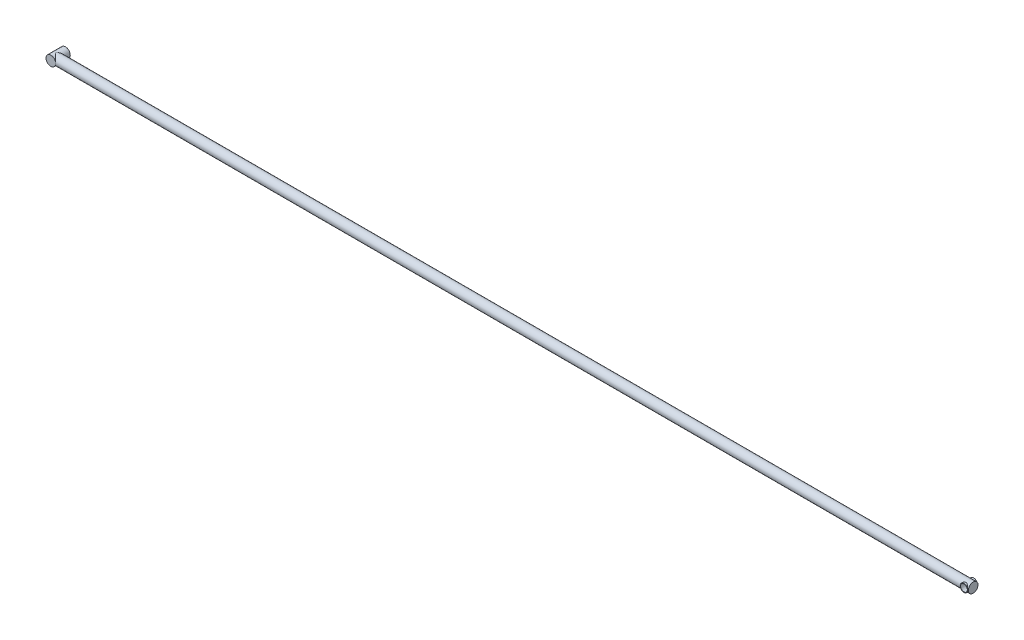
ISO-10303-21;
HEADER;
FILE_DESCRIPTION(('STEP AP214'),'2;1');
FILE_NAME('part.step','',(''),(''),'','','');
FILE_SCHEMA(('AUTOMOTIVE_DESIGN { 1 0 10303 214 1 1 1 1 }'));
ENDSEC;
DATA;
#1=APPLICATION_CONTEXT('core data for automotive mechanical design processes');
#2=APPLICATION_PROTOCOL_DEFINITION('international standard','automotive_design',2000,#1);
#3=PRODUCT_CONTEXT('',#1,'mechanical');
#4=PRODUCT('Part','Part','',(#3));
#5=PRODUCT_RELATED_PRODUCT_CATEGORY('part','',(#4));
#6=PRODUCT_DEFINITION_FORMATION('','',#4);
#7=PRODUCT_DEFINITION_CONTEXT('part definition',#1,'design');
#8=PRODUCT_DEFINITION('design','',#6,#7);
#9=PRODUCT_DEFINITION_SHAPE('','',#8);
#10=(LENGTH_UNIT() NAMED_UNIT(*) SI_UNIT(.MILLI.,.METRE.));
#11=(NAMED_UNIT(*) PLANE_ANGLE_UNIT() SI_UNIT($,.RADIAN.));
#12=(NAMED_UNIT(*) SI_UNIT($,.STERADIAN.) SOLID_ANGLE_UNIT());
#13=UNCERTAINTY_MEASURE_WITH_UNIT(LENGTH_MEASURE(1.E-05),#10,'distance_accuracy_value','');
#14=(GEOMETRIC_REPRESENTATION_CONTEXT(3) GLOBAL_UNCERTAINTY_ASSIGNED_CONTEXT((#13)) GLOBAL_UNIT_ASSIGNED_CONTEXT((#10,
#11,#12)) REPRESENTATION_CONTEXT('',''));
#15=CARTESIAN_POINT('',(0.,0.,0.));
#16=DIRECTION('',(0.,0.,1.));
#17=DIRECTION('',(1.,0.,0.));
#18=AXIS2_PLACEMENT_3D('',#15,#16,#17);
#19=CARTESIAN_POINT('',(0.,0.,-3.));
#20=DIRECTION('',(0.,0.,1.));
#21=DIRECTION('',(1.,0.,0.));
#22=AXIS2_PLACEMENT_3D('',#19,#20,#21);
#23=CYLINDRICAL_SURFACE('',#22,1.);
#24=CARTESIAN_POINT('',(0.,0.,-3.));
#25=DIRECTION('',(0.,0.,1.));
#26=DIRECTION('',(1.,0.,0.));
#27=AXIS2_PLACEMENT_3D('',#24,#25,#26);
#28=CIRCLE('',#27,1.);
#29=CARTESIAN_POINT('',(1.,0.,-3.));
#30=VERTEX_POINT('',#29);
#31=EDGE_CURVE('E77',#30,#30,#28,.T.);
#32=ORIENTED_EDGE('',*,*,#31,.T.);
#33=EDGE_LOOP('',(#32));
#34=FACE_BOUND('',#33,.T.);
#35=CARTESIAN_POINT('',(0.,0.,-1.));
#36=DIRECTION('',(0.707106781186547,0.,0.707106781186547));
#37=DIRECTION('',(-0.707106781186547,0.,0.707106781186547));
#38=AXIS2_PLACEMENT_3D('',#35,#36,#37);
#39=ELLIPSE('',#38,1.41421356237309,1.);
#40=CARTESIAN_POINT('',(0.,1.,-1.));
#41=VERTEX_POINT('',#40);
#42=CARTESIAN_POINT('',(0.,-1.,-1.));
#43=VERTEX_POINT('',#42);
#44=EDGE_CURVE('E139',#41,#43,#39,.F.);
#45=ORIENTED_EDGE('',*,*,#44,.T.);
#46=CARTESIAN_POINT('',(0.,0.,-1.));
#47=DIRECTION('',(-0.707106781186547,0.,0.707106781186547));
#48=DIRECTION('',(0.707106781186547,0.,0.707106781186547));
#49=AXIS2_PLACEMENT_3D('',#46,#47,#48);
#50=ELLIPSE('',#49,1.41421356237309,1.);
#51=CARTESIAN_POINT('',(1.,0.,0.));
#52=VERTEX_POINT('',#51);
#53=EDGE_CURVE('E141',#43,#52,#50,.T.);
#54=ORIENTED_EDGE('',*,*,#53,.T.);
#55=CARTESIAN_POINT('',(0.,0.,0.));
#56=DIRECTION('',(0.,0.,1.));
#57=DIRECTION('',(1.,0.,0.));
#58=AXIS2_PLACEMENT_3D('',#55,#56,#57);
#59=CIRCLE('',#58,1.);
#60=EDGE_CURVE('E96',#52,#52,#59,.T.);
#61=ORIENTED_EDGE('',*,*,#60,.F.);
#62=EDGE_CURVE('E143',#52,#41,#50,.T.);
#63=ORIENTED_EDGE('',*,*,#62,.T.);
#64=EDGE_LOOP('',(#45,#54,#61,#63));
#65=FACE_BOUND('',#64,.T.);
#66=ADVANCED_FACE('F34',(#34,#65),#23,.T.);
#67=CARTESIAN_POINT('',(0.,0.,-3.));
#68=DIRECTION('',(0.,0.,1.));
#69=DIRECTION('',(1.,0.,0.));
#70=AXIS2_PLACEMENT_3D('',#67,#68,#69);
#71=PLANE('',#70);
#72=ORIENTED_EDGE('',*,*,#31,.F.);
#73=EDGE_LOOP('',(#72));
#74=FACE_BOUND('',#73,.T.);
#75=ADVANCED_FACE('F125',(#74),#71,.F.);
#76=CARTESIAN_POINT('',(0.,0.,0.));
#77=DIRECTION('',(0.,0.,1.));
#78=DIRECTION('',(1.,0.,0.));
#79=AXIS2_PLACEMENT_3D('',#76,#77,#78);
#80=PLANE('',#79);
#81=ORIENTED_EDGE('',*,*,#60,.T.);
#82=EDGE_LOOP('',(#81));
#83=FACE_BOUND('',#82,.T.);
#84=ADVANCED_FACE('F121',(#83),#80,.T.);
#85=CARTESIAN_POINT('',(189.,0.,-1.));
#86=DIRECTION('',(-1.,0.,0.));
#87=DIRECTION('',(0.,0.,1.));
#88=AXIS2_PLACEMENT_3D('',#85,#86,#87);
#89=CYLINDRICAL_SURFACE('',#88,1.);
#90=CARTESIAN_POINT('',(188.9,0.,-2.));
#91=CARTESIAN_POINT('',(188.899997007206,0.0383988184238274,-1.99999709500428));
#92=CARTESIAN_POINT('',(188.897212238988,0.0768532932360713,-1.99776548309159));
#93=CARTESIAN_POINT('',(188.886260013507,0.152527730105215,-1.98903706797755));
#94=CARTESIAN_POINT('',(188.878080648694,0.189744769427959,-1.98253082947096));
#95=CARTESIAN_POINT('',(188.856928691225,0.261637971003245,-1.96586688977529));
#96=CARTESIAN_POINT('',(188.84398666018,0.296328680407636,-1.95573248125754));
#97=CARTESIAN_POINT('',(188.813953061856,0.36277052832058,-1.93254404330554));
#98=CARTESIAN_POINT('',(188.796861481431,0.394521657516348,-1.91949000462215));
#99=CARTESIAN_POINT('',(188.752548654296,0.465272495101696,-1.88630265919739));
#100=CARTESIAN_POINT('',(188.723872434011,0.502947071936824,-1.86528699449775));
#101=CARTESIAN_POINT('',(188.661088773624,0.572165471182798,-1.82116877032697));
#102=CARTESIAN_POINT('',(188.626965698586,0.603691046094579,-1.79806028874422));
#103=CARTESIAN_POINT('',(188.553290406384,0.660863675860785,-1.75142400657806));
#104=CARTESIAN_POINT('',(188.513661290778,0.6864105538518,-1.72789532375698));
#105=CARTESIAN_POINT('',(188.429384487029,0.73058733763157,-1.68352843938361));
#106=CARTESIAN_POINT('',(188.384754266582,0.749240397492759,-1.66268138782259));
#107=CARTESIAN_POINT('',(188.310448419265,0.772344175113191,-1.63534260951618));
#108=CARTESIAN_POINT('',(188.2824753046,0.779461903363269,-1.62651491200873));
#109=CARTESIAN_POINT('',(188.225114926144,0.790693587271244,-1.61227955751338));
#110=CARTESIAN_POINT('',(188.195731330526,0.794814927548166,-1.60686349695837));
#111=CARTESIAN_POINT('',(188.135922992499,0.79975936055038,-1.60033693600105));
#112=CARTESIAN_POINT('',(188.105491406085,0.800553382448333,-1.59926438764069));
#113=CARTESIAN_POINT('',(188.044918043175,0.798677926804133,-1.60175984927679));
#114=CARTESIAN_POINT('',(188.014776533691,0.79600551804599,-1.60533178665961));
#115=CARTESIAN_POINT('',(187.95111107896,0.78678121084623,-1.61728288517784));
#116=CARTESIAN_POINT('',(187.917796797581,0.779687232822299,-1.62632736819179));
#117=CARTESIAN_POINT('',(187.853385776186,0.761778189396367,-1.64798983975051));
#118=CARTESIAN_POINT('',(187.822295937385,0.750952102569794,-1.6606183927959));
#119=CARTESIAN_POINT('',(187.747735157586,0.719896408776743,-1.69462446463391));
#120=CARTESIAN_POINT('',(187.70567892068,0.697659546382339,-1.7172534918703));
#121=CARTESIAN_POINT('',(187.626513328882,0.646553869991959,-1.76365512024313));
#122=CARTESIAN_POINT('',(187.589411311663,0.617675387613268,-1.78742934819739));
#123=CARTESIAN_POINT('',(187.519490091441,0.552583273305201,-1.83445100786985));
#124=CARTESIAN_POINT('',(187.486811231083,0.5161948041019,-1.85766755703212));
#125=CARTESIAN_POINT('',(187.427960200224,0.436793964300714,-1.90068748598873));
#126=CARTESIAN_POINT('',(187.40177059354,0.393799858112006,-1.92049996732527));
#127=CARTESIAN_POINT('',(187.363774861047,0.315111125734042,-1.9496983425464));
#128=CARTESIAN_POINT('',(187.349998198259,0.28087109086708,-1.96044428481182));
#129=CARTESIAN_POINT('',(187.327149419572,0.209965569564642,-1.97839025652914));
#130=CARTESIAN_POINT('',(187.3180737579,0.173301934759327,-1.98559295829723));
#131=CARTESIAN_POINT('',(187.305144581349,0.0982852932914146,-1.99588134242894));
#132=CARTESIAN_POINT('',(187.301318350564,0.0599245219564389,-1.99894551336965));
#133=CARTESIAN_POINT('',(187.299256379948,-0.0170432002137318,-2.00059473197216));
#134=CARTESIAN_POINT('',(187.301019598749,-0.0556501038545762,-1.99918061398305));
#135=CARTESIAN_POINT('',(187.309633128081,-0.128698672852847,-1.99230743057758));
#136=CARTESIAN_POINT('',(187.316059675739,-0.163224368168212,-1.98718539527357));
#137=CARTESIAN_POINT('',(187.333148866754,-0.230534258218332,-1.97367006720567));
#138=CARTESIAN_POINT('',(187.343812767275,-0.263317932844229,-1.96527580363115));
#139=CARTESIAN_POINT('',(187.369660171184,-0.328494396354752,-1.94515934100558));
#140=CARTESIAN_POINT('',(187.385082400636,-0.360737621788019,-1.9332634332322));
#141=CARTESIAN_POINT('',(187.419544774393,-0.422163827760468,-1.90713470861629));
#142=CARTESIAN_POINT('',(187.438585099123,-0.451346655573637,-1.89290177523775));
#143=CARTESIAN_POINT('',(187.483690110906,-0.511701724183926,-1.8599737818676));
#144=CARTESIAN_POINT('',(187.510402233693,-0.542206018242515,-1.84094394776234));
#145=CARTESIAN_POINT('',(187.567753222524,-0.598611598933971,-1.80177793453424));
#146=CARTESIAN_POINT('',(187.598403263392,-0.624499265200878,-1.781638703905));
#147=CARTESIAN_POINT('',(187.670260676382,-0.676534836949612,-1.73735811058213));
#148=CARTESIAN_POINT('',(187.712325291453,-0.701559782874482,-1.71327964651759));
#149=CARTESIAN_POINT('',(187.801895020927,-0.744021885787673,-1.66885410515103));
#150=CARTESIAN_POINT('',(187.84937528417,-0.761492069551527,-1.6484910162033));
#151=CARTESIAN_POINT('',(187.926442749103,-0.781441819493645,-1.62407961509861));
#152=CARTESIAN_POINT('',(187.954171235322,-0.787118545245271,-1.6168393843176));
#153=CARTESIAN_POINT('',(188.010732881242,-0.795515316907812,-1.60597297022971));
#154=CARTESIAN_POINT('',(188.039563062349,-0.798242821655665,-1.60233767167676));
#155=CARTESIAN_POINT('',(188.097740111358,-0.800528305887114,-1.5992990854083));
#156=CARTESIAN_POINT('',(188.127088918031,-0.800069255116061,-1.59991853662851));
#157=CARTESIAN_POINT('',(188.185193340301,-0.795986102218333,-1.60532305377647));
#158=CARTESIAN_POINT('',(188.213947941411,-0.792356982103112,-1.61011472398417));
#159=CARTESIAN_POINT('',(188.27784362408,-0.780830769579076,-1.62482829861939));
#160=CARTESIAN_POINT('',(188.312572844918,-0.77203598984975,-1.63579694184903));
#161=CARTESIAN_POINT('',(188.379449768839,-0.750433643419315,-1.66115572266825));
#162=CARTESIAN_POINT('',(188.411589511766,-0.737614255207881,-1.67555590933523));
#163=CARTESIAN_POINT('',(188.487289634737,-0.701764098152088,-1.71306893211556));
#164=CARTESIAN_POINT('',(188.529413936743,-0.676739364981787,-1.73717005374725));
#165=CARTESIAN_POINT('',(188.608338747189,-0.619647884220962,-1.78578106841786));
#166=CARTESIAN_POINT('',(188.645133141492,-0.5875731537999,-1.8102913954989));
#167=CARTESIAN_POINT('',(188.713341941117,-0.516028161849087,-1.85766079519216));
#168=CARTESIAN_POINT('',(188.744680043162,-0.476467028760417,-1.88049420681686));
#169=CARTESIAN_POINT('',(188.800040480081,-0.390554782427496,-1.92180245935973));
#170=CARTESIAN_POINT('',(188.824084391598,-0.344224307819148,-1.94029011800508));
#171=CARTESIAN_POINT('',(188.856721018633,-0.262001285572037,-1.96569174795565));
#172=CARTESIAN_POINT('',(188.867795404183,-0.227640510026857,-1.97441368143914));
#173=CARTESIAN_POINT('',(188.885260740045,-0.157088815338218,-1.98823335557809));
#174=CARTESIAN_POINT('',(188.891663957877,-0.120902958745622,-1.99334058817715));
#175=CARTESIAN_POINT('',(188.89702534682,-0.0703521626450389,-1.99762163663924));
#176=CARTESIAN_POINT('',(188.898138989229,-0.056323363200636,-1.99851170914011));
#177=CARTESIAN_POINT('',(188.899626947672,-0.0281988879021953,-1.99970148997743));
#178=CARTESIAN_POINT('',(188.900001099199,-0.0141031978666801,-2.00000106695287));
#179=CARTESIAN_POINT('',(188.9,0.,-2.));
#180=B_SPLINE_CURVE_WITH_KNOTS('',3,(#90,#91,#92,#93,#94,#95,#96,#97,#98,#99,#100,#101,#102,
#103,#104,#105,#106,#107,#108,#109,#110,#111,#112,#113,#114,#115,#116,#117,#118,#119,#120,#121,
#122,#123,#124,#125,#126,#127,#128,#129,#130,#131,#132,#133,#134,#135,#136,#137,#138,#139,#140,
#141,#142,#143,#144,#145,#146,#147,#148,#149,#150,#151,#152,#153,#154,#155,#156,#157,#158,#159,
#160,#161,#162,#163,#164,#165,#166,#167,#168,#169,#170,#171,#172,#173,#174,#175,#176,#177,#178,
#179),.UNSPECIFIED.,.T.,.F.,(4,2,2,2,2,2,2,2,2,2,2,2,2,2,2,2,2,2,2,2,2,2,2,2,2,2,2,2,2,2,2,2,2,
2,2,2,2,2,2,2,2,2,2,2,4),(0.,0.115134642396886,0.230524277055734,0.34518602290023,
0.459848131988321,0.614431552800416,0.769466952751411,0.926938967061937,1.08387717170052,
1.17413794531674,1.26417550952799,1.35499811389818,1.44589756801015,1.55103452002265,
1.65648465387712,1.81370299264718,1.97115166344034,2.13279269304707,2.29399457605586,
2.40885591239256,2.52363048684902,2.63899937445361,2.75434676896905,2.86034801964662,
2.96638074293231,3.07897101210013,3.19156689729911,3.32546214889074,3.45974611977677,
3.62268108273939,3.78489636759474,3.872224845339,3.95933194141159,4.04690493045575,
4.13461679287078,4.2463895328811,4.35849370485496,4.52147127555062,4.68463434799969,
4.84992227782979,5.01471639865701,5.12569840029585,5.23638787894728,5.27866536584166,
5.3209522566806),.UNSPECIFIED.);
#181=CARTESIAN_POINT('',(187.3,0.,-2.));
#182=VERTEX_POINT('',#181);
#183=CARTESIAN_POINT('',(188.9,0.,-2.));
#184=VERTEX_POINT('',#183);
#185=EDGE_CURVE('E42',#182,#184,#180,.T.);
#186=ORIENTED_EDGE('',*,*,#185,.T.);
#187=EDGE_CURVE('E11',#184,#182,#180,.T.);
#188=ORIENTED_EDGE('',*,*,#187,.T.);
#189=EDGE_LOOP('',(#186,#188));
#190=FACE_BOUND('',#189,.T.);
#191=CARTESIAN_POINT('',(188.9,0.,0.));
#192=CARTESIAN_POINT('',(188.899997007206,-0.0383988184238274,-2.9049957159181E-06));
#193=CARTESIAN_POINT('',(188.897212238988,-0.0768532932360713,-0.00223451690841412));
#194=CARTESIAN_POINT('',(188.886260013507,-0.152527730105215,-0.0109629320224536));
#195=CARTESIAN_POINT('',(188.878080648694,-0.189744769427959,-0.0174691705290418));
#196=CARTESIAN_POINT('',(188.856928691225,-0.261637971003245,-0.0341331102247126));
#197=CARTESIAN_POINT('',(188.84398666018,-0.296328680407636,-0.0442675187424614));
#198=CARTESIAN_POINT('',(188.813953061856,-0.36277052832058,-0.0674559566944645));
#199=CARTESIAN_POINT('',(188.796861481431,-0.394521657516348,-0.0805099953778537));
#200=CARTESIAN_POINT('',(188.752548654296,-0.465272495101696,-0.113697340802611));
#201=CARTESIAN_POINT('',(188.723872434011,-0.502947071936824,-0.134713005502251));
#202=CARTESIAN_POINT('',(188.661088773624,-0.572165471182798,-0.178831229673027));
#203=CARTESIAN_POINT('',(188.626965698586,-0.603691046094579,-0.201939711255781));
#204=CARTESIAN_POINT('',(188.553290406384,-0.660863675860791,-0.248575993421949));
#205=CARTESIAN_POINT('',(188.513661290778,-0.686410553851809,-0.272104676243032));
#206=CARTESIAN_POINT('',(188.429384487029,-0.730587337631577,-0.316471560616396));
#207=CARTESIAN_POINT('',(188.384754266582,-0.749240397492762,-0.337318612177417));
#208=CARTESIAN_POINT('',(188.310448419265,-0.772344175113194,-0.364657390483821));
#209=CARTESIAN_POINT('',(188.282475304599,-0.779461903363273,-0.373485087991273));
#210=CARTESIAN_POINT('',(188.225114926144,-0.790693587271247,-0.387720442486624));
#211=CARTESIAN_POINT('',(188.195731330526,-0.794814927548167,-0.393136503041628));
#212=CARTESIAN_POINT('',(188.135922992499,-0.799759360550382,-0.399663063998949));
#213=CARTESIAN_POINT('',(188.105491406085,-0.800553382448334,-0.400735612359316));
#214=CARTESIAN_POINT('',(188.044918043175,-0.79867792680413,-0.398240150723204));
#215=CARTESIAN_POINT('',(188.014776533691,-0.796005518045988,-0.394668213340391));
#216=CARTESIAN_POINT('',(187.95111107896,-0.786781210846231,-0.382717114822162));
#217=CARTESIAN_POINT('',(187.917796797581,-0.779687232822303,-0.373672631808218));
#218=CARTESIAN_POINT('',(187.853385776186,-0.761778189396374,-0.3520101602495));
#219=CARTESIAN_POINT('',(187.822295937385,-0.750952102569797,-0.339381607204108));
#220=CARTESIAN_POINT('',(187.747735157586,-0.719896408776743,-0.305375535366089));
#221=CARTESIAN_POINT('',(187.70567892068,-0.697659546382339,-0.282746508129702));
#222=CARTESIAN_POINT('',(187.626513328882,-0.646553869991959,-0.236344879756871));
#223=CARTESIAN_POINT('',(187.589411311663,-0.617675387613268,-0.212570651802608));
#224=CARTESIAN_POINT('',(187.519490091441,-0.552583273305201,-0.165548992130147));
#225=CARTESIAN_POINT('',(187.486811231083,-0.5161948041019,-0.142332442967884));
#226=CARTESIAN_POINT('',(187.427960200224,-0.436793964300714,-0.0993125140112719));
#227=CARTESIAN_POINT('',(187.40177059354,-0.393799858112006,-0.0795000326747282));
#228=CARTESIAN_POINT('',(187.363774861047,-0.315111125734042,-0.0503016574536035));
#229=CARTESIAN_POINT('',(187.349998198259,-0.28087109086708,-0.0395557151881751));
#230=CARTESIAN_POINT('',(187.327149419572,-0.209965569564642,-0.0216097434708605));
#231=CARTESIAN_POINT('',(187.3180737579,-0.173301934759327,-0.0144070417027719));
#232=CARTESIAN_POINT('',(187.305144581349,-0.0982852932914145,-0.00411865757106387));
#233=CARTESIAN_POINT('',(187.301318350564,-0.0599245219564388,-0.00105448663035486));
#234=CARTESIAN_POINT('',(187.299256379948,0.017043200213732,0.000594731972156083));
#235=CARTESIAN_POINT('',(187.301019598749,0.0556501038545764,-0.000819386016949891));
#236=CARTESIAN_POINT('',(187.309633128081,0.128698672852847,-0.00769256942241877));
#237=CARTESIAN_POINT('',(187.316059675739,0.163224368168212,-0.0128146047264316));
#238=CARTESIAN_POINT('',(187.333148866754,0.230534258218332,-0.0263299327943278));
#239=CARTESIAN_POINT('',(187.343812767275,0.263317932844229,-0.0347241963688452));
#240=CARTESIAN_POINT('',(187.369660171184,0.328494396354752,-0.0548406589944203));
#241=CARTESIAN_POINT('',(187.385082400636,0.360737621788019,-0.0667365667678012));
#242=CARTESIAN_POINT('',(187.419544774393,0.422163827760468,-0.0928652913837065));
#243=CARTESIAN_POINT('',(187.438585099123,0.451346655573637,-0.10709822476225));
#244=CARTESIAN_POINT('',(187.483690110906,0.511701724183926,-0.140026218132403));
#245=CARTESIAN_POINT('',(187.510402233693,0.542206018242515,-0.159056052237658));
#246=CARTESIAN_POINT('',(187.567753222524,0.598611598933971,-0.198222065465758));
#247=CARTESIAN_POINT('',(187.598403263392,0.624499265200878,-0.218361296095003));
#248=CARTESIAN_POINT('',(187.670260676382,0.676534836949612,-0.26264188941787));
#249=CARTESIAN_POINT('',(187.712325291453,0.701559782874482,-0.286720353482407));
#250=CARTESIAN_POINT('',(187.801895020927,0.744021885787673,-0.331145894848968));
#251=CARTESIAN_POINT('',(187.84937528417,0.761492069551527,-0.351508983796704));
#252=CARTESIAN_POINT('',(187.926442749103,0.781441819493645,-0.37592038490139));
#253=CARTESIAN_POINT('',(187.954171235322,0.787118545245271,-0.383160615682395));
#254=CARTESIAN_POINT('',(188.010732881242,0.795515316907812,-0.394027029770294));
#255=CARTESIAN_POINT('',(188.039563062349,0.798242821655665,-0.397662328323244));
#256=CARTESIAN_POINT('',(188.097740111358,0.800528305887114,-0.400700914591701));
#257=CARTESIAN_POINT('',(188.127088918031,0.800069255116061,-0.400081463371486));
#258=CARTESIAN_POINT('',(188.185193340301,0.795986102218333,-0.394676946223533));
#259=CARTESIAN_POINT('',(188.213947941411,0.792356982103112,-0.38988527601583));
#260=CARTESIAN_POINT('',(188.27784362408,0.780830769579076,-0.375171701380612));
#261=CARTESIAN_POINT('',(188.312572844918,0.77203598984975,-0.364203058150974));
#262=CARTESIAN_POINT('',(188.379449768839,0.750433643419315,-0.338844277331754));
#263=CARTESIAN_POINT('',(188.411589511766,0.737614255207881,-0.324444090664768));
#264=CARTESIAN_POINT('',(188.487289634737,0.701764098152088,-0.286931067884442));
#265=CARTESIAN_POINT('',(188.529413936743,0.676739364981787,-0.262829946252753));
#266=CARTESIAN_POINT('',(188.608338747189,0.619647884220962,-0.214218931582136));
#267=CARTESIAN_POINT('',(188.645133141492,0.5875731537999,-0.189708604501095));
#268=CARTESIAN_POINT('',(188.713341941117,0.516028161849087,-0.142339204807845));
#269=CARTESIAN_POINT('',(188.744680043162,0.476467028760417,-0.119505793183137));
#270=CARTESIAN_POINT('',(188.800040480081,0.390554782427496,-0.0781975406402674));
#271=CARTESIAN_POINT('',(188.824084391598,0.344224307819148,-0.0597098819949182));
#272=CARTESIAN_POINT('',(188.856721018633,0.262001285572037,-0.0343082520443464));
#273=CARTESIAN_POINT('',(188.867795404183,0.227640510026856,-0.025586318560859));
#274=CARTESIAN_POINT('',(188.885260740045,0.157088815338218,-0.0117666444219079));
#275=CARTESIAN_POINT('',(188.891663957877,0.120902958745621,-0.00665941182284615));
#276=CARTESIAN_POINT('',(188.89702534682,0.0703521626450388,-0.00237836336076219));
#277=CARTESIAN_POINT('',(188.898138989229,0.0563233632006359,-0.00148829085989381));
#278=CARTESIAN_POINT('',(188.899626947672,0.0281988879021953,-0.000298510022570839));
#279=CARTESIAN_POINT('',(188.900001099199,0.0141031978666801,1.06695286639414E-06));
#280=CARTESIAN_POINT('',(188.9,0.,0.));
#281=B_SPLINE_CURVE_WITH_KNOTS('',3,(#191,#192,#193,#194,#195,#196,#197,#198,#199,#200,#201,
#202,#203,#204,#205,#206,#207,#208,#209,#210,#211,#212,#213,#214,#215,#216,#217,#218,#219,#220,
#221,#222,#223,#224,#225,#226,#227,#228,#229,#230,#231,#232,#233,#234,#235,#236,#237,#238,#239,
#240,#241,#242,#243,#244,#245,#246,#247,#248,#249,#250,#251,#252,#253,#254,#255,#256,#257,#258,
#259,#260,#261,#262,#263,#264,#265,#266,#267,#268,#269,#270,#271,#272,#273,#274,#275,#276,#277,
#278,#279,#280),.UNSPECIFIED.,.T.,.F.,(4,2,2,2,2,2,2,2,2,2,2,2,2,2,2,2,2,2,2,2,2,2,2,2,2,2,2,2,
2,2,2,2,2,2,2,2,2,2,2,2,2,2,2,2,4),(0.,0.115134642396886,0.230524277055734,0.34518602290023,
0.459848131988321,0.614431552800416,0.769466952751411,0.92693896706197,1.08387717170052,
1.17413794531677,1.26417550952799,1.35499811389823,1.44589756801015,1.55103452002262,
1.65648465387712,1.81370299264718,1.97115166344034,2.13279269304707,2.29399457605586,
2.40885591239256,2.52363048684902,2.63899937445361,2.75434676896905,2.86034801964662,
2.96638074293231,3.07897101210013,3.19156689729911,3.32546214889074,3.45974611977677,
3.62268108273939,3.78489636759474,3.872224845339,3.95933194141159,4.04690493045575,
4.13461679287078,4.2463895328811,4.35849370485496,4.52147127555062,4.68463434799969,
4.84992227782979,5.01471639865701,5.12569840029585,5.23638787894728,5.27866536584166,
5.3209522566806),.UNSPECIFIED.);
#282=CARTESIAN_POINT('',(187.3,0.,0.));
#283=VERTEX_POINT('',#282);
#284=CARTESIAN_POINT('',(188.9,0.,0.));
#285=VERTEX_POINT('',#284);
#286=EDGE_CURVE('E71',#283,#285,#281,.T.);
#287=ORIENTED_EDGE('',*,*,#286,.T.);
#288=EDGE_CURVE('E76',#285,#283,#281,.T.);
#289=ORIENTED_EDGE('',*,*,#288,.T.);
#290=EDGE_LOOP('',(#287,#289));
#291=FACE_BOUND('',#290,.T.);
#292=ORIENTED_EDGE('',*,*,#53,.F.);
#293=ORIENTED_EDGE('',*,*,#44,.F.);
#294=ORIENTED_EDGE('',*,*,#62,.F.);
#295=EDGE_LOOP('',(#292,#293,#294));
#296=FACE_BOUND('',#295,.T.);
#297=CARTESIAN_POINT('',(189.,0.,-1.));
#298=DIRECTION('',(1.,0.,0.));
#299=DIRECTION('',(0.,0.,-1.));
#300=AXIS2_PLACEMENT_3D('',#297,#298,#299);
#301=CIRCLE('',#300,1.);
#302=CARTESIAN_POINT('',(189.,0.,-2.));
#303=VERTEX_POINT('',#302);
#304=EDGE_CURVE('E146',#303,#303,#301,.T.);
#305=ORIENTED_EDGE('',*,*,#304,.F.);
#306=EDGE_LOOP('',(#305));
#307=FACE_BOUND('',#306,.T.);
#308=ADVANCED_FACE('F87',(#190,#291,#296,#307),#89,.T.);
#309=CARTESIAN_POINT('',(189.,0.,-1.));
#310=DIRECTION('',(1.,0.,0.));
#311=DIRECTION('',(0.,0.,-1.));
#312=AXIS2_PLACEMENT_3D('',#309,#310,#311);
#313=PLANE('',#312);
#314=ORIENTED_EDGE('',*,*,#304,.T.);
#315=EDGE_LOOP('',(#314));
#316=FACE_BOUND('',#315,.T.);
#317=ADVANCED_FACE('F111',(#316),#313,.T.);
#318=CARTESIAN_POINT('',(188.1,0.,0.));
#319=DIRECTION('',(0.,0.,1.));
#320=DIRECTION('',(1.,0.,0.));
#321=AXIS2_PLACEMENT_3D('',#318,#319,#320);
#322=PLANE('',#321);
#323=CARTESIAN_POINT('',(188.1,0.,0.));
#324=DIRECTION('',(0.,0.,1.));
#325=DIRECTION('',(1.,0.,0.));
#326=AXIS2_PLACEMENT_3D('',#323,#324,#325);
#327=CIRCLE('',#326,0.700000000000015);
#328=CARTESIAN_POINT('',(188.8,0.,0.));
#329=VERTEX_POINT('',#328);
#330=EDGE_CURVE('E217',#329,#329,#327,.T.);
#331=ORIENTED_EDGE('',*,*,#330,.F.);
#332=EDGE_LOOP('',(#331));
#333=FACE_BOUND('',#332,.T.);
#334=CARTESIAN_POINT('',(188.1,0.,0.));
#335=DIRECTION('',(0.,0.,1.));
#336=DIRECTION('',(1.,0.,0.));
#337=AXIS2_PLACEMENT_3D('',#334,#335,#336);
#338=CIRCLE('',#337,0.799999999999982);
#339=EDGE_CURVE('E55',#285,#283,#338,.T.);
#340=ORIENTED_EDGE('',*,*,#339,.T.);
#341=EDGE_CURVE('E81',#283,#285,#338,.T.);
#342=ORIENTED_EDGE('',*,*,#341,.T.);
#343=EDGE_LOOP('',(#340,#342));
#344=FACE_BOUND('',#343,.T.);
#345=ADVANCED_FACE('F85',(#333,#344),#322,.T.);
#346=CARTESIAN_POINT('',(188.1,0.,-2.));
#347=DIRECTION('',(0.,0.,1.));
#348=DIRECTION('',(1.,0.,0.));
#349=AXIS2_PLACEMENT_3D('',#346,#347,#348);
#350=CYLINDRICAL_SURFACE('',#349,0.799999999999982);
#351=ORIENTED_EDGE('',*,*,#286,.F.);
#352=ORIENTED_EDGE('',*,*,#339,.F.);
#353=EDGE_LOOP('',(#351,#352));
#354=FACE_BOUND('',#353,.T.);
#355=ADVANCED_FACE('F73',(#354),#350,.T.);
#356=ORIENTED_EDGE('',*,*,#288,.F.);
#357=ORIENTED_EDGE('',*,*,#341,.F.);
#358=EDGE_LOOP('',(#356,#357));
#359=FACE_BOUND('',#358,.T.);
#360=ADVANCED_FACE('F82',(#359),#350,.T.);
#361=ORIENTED_EDGE('',*,*,#187,.F.);
#362=CARTESIAN_POINT('',(188.1,0.,-2.));
#363=DIRECTION('',(0.,0.,1.));
#364=DIRECTION('',(1.,0.,0.));
#365=AXIS2_PLACEMENT_3D('',#362,#363,#364);
#366=CIRCLE('',#365,0.799999999999982);
#367=EDGE_CURVE('E48',#184,#182,#366,.T.);
#368=ORIENTED_EDGE('',*,*,#367,.T.);
#369=EDGE_LOOP('',(#361,#368));
#370=FACE_BOUND('',#369,.T.);
#371=ADVANCED_FACE('F104',(#370),#350,.T.);
#372=ORIENTED_EDGE('',*,*,#185,.F.);
#373=EDGE_CURVE('E86',#182,#184,#366,.T.);
#374=ORIENTED_EDGE('',*,*,#373,.T.);
#375=EDGE_LOOP('',(#372,#374));
#376=FACE_BOUND('',#375,.T.);
#377=ADVANCED_FACE('F108',(#376),#350,.T.);
#378=CARTESIAN_POINT('',(188.1,0.,-2.));
#379=DIRECTION('',(0.,0.,1.));
#380=DIRECTION('',(1.,0.,0.));
#381=AXIS2_PLACEMENT_3D('',#378,#379,#380);
#382=PLANE('',#381);
#383=CARTESIAN_POINT('',(188.1,0.,-2.));
#384=DIRECTION('',(0.,0.,1.));
#385=DIRECTION('',(1.,0.,0.));
#386=AXIS2_PLACEMENT_3D('',#383,#384,#385);
#387=CIRCLE('',#386,0.700000000000015);
#388=CARTESIAN_POINT('',(188.8,0.,-2.));
#389=VERTEX_POINT('',#388);
#390=EDGE_CURVE('E37',#389,#389,#387,.T.);
#391=ORIENTED_EDGE('',*,*,#390,.T.);
#392=EDGE_LOOP('',(#391));
#393=FACE_BOUND('',#392,.T.);
#394=ORIENTED_EDGE('',*,*,#367,.F.);
#395=ORIENTED_EDGE('',*,*,#373,.F.);
#396=EDGE_LOOP('',(#394,#395));
#397=FACE_BOUND('',#396,.T.);
#398=ADVANCED_FACE('F187',(#393,#397),#382,.F.);
#399=CARTESIAN_POINT('',(188.1,0.,-3.));
#400=DIRECTION('',(0.,0.,1.));
#401=DIRECTION('',(1.,0.,0.));
#402=AXIS2_PLACEMENT_3D('',#399,#400,#401);
#403=CYLINDRICAL_SURFACE('',#402,0.700000000000015);
#404=ORIENTED_EDGE('',*,*,#330,.T.);
#405=EDGE_LOOP('',(#404));
#406=FACE_BOUND('',#405,.T.);
#407=ORIENTED_EDGE('',*,*,#390,.F.);
#408=EDGE_LOOP('',(#407));
#409=FACE_BOUND('',#408,.T.);
#410=ADVANCED_FACE('F201',(#406,#409),#403,.F.);
#411=CLOSED_SHELL('',(#66,#75,#84,#308,#317,#345,#355,#360,#371,#377,#398,#410));
#412=MANIFOLD_SOLID_BREP('B2',#411);
#413=ADVANCED_BREP_SHAPE_REPRESENTATION('',(#18,#412),#14);
#414=SHAPE_DEFINITION_REPRESENTATION(#9,#413);
ENDSEC;
END-ISO-10303-21;
